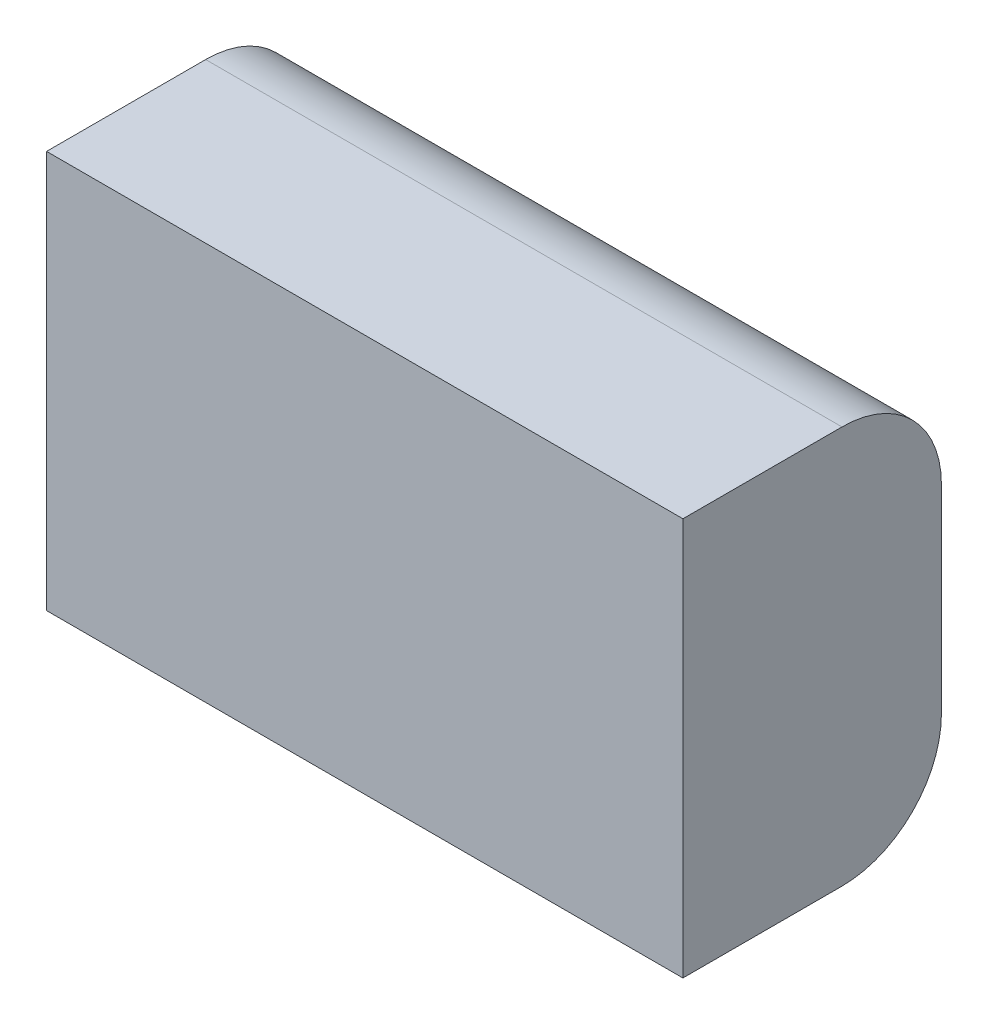
ISO-10303-21;
HEADER;
FILE_DESCRIPTION(('STEP AP214'),'2;1');
FILE_NAME('part.step','',(''),(''),'','','');
FILE_SCHEMA(('AUTOMOTIVE_DESIGN { 1 0 10303 214 1 1 1 1 }'));
ENDSEC;
DATA;
#1=APPLICATION_CONTEXT('core data for automotive mechanical design processes');
#2=APPLICATION_PROTOCOL_DEFINITION('international standard','automotive_design',2000,#1);
#3=PRODUCT_CONTEXT('',#1,'mechanical');
#4=PRODUCT('Part','Part','',(#3));
#5=PRODUCT_RELATED_PRODUCT_CATEGORY('part','',(#4));
#6=PRODUCT_DEFINITION_FORMATION('','',#4);
#7=PRODUCT_DEFINITION_CONTEXT('part definition',#1,'design');
#8=PRODUCT_DEFINITION('design','',#6,#7);
#9=PRODUCT_DEFINITION_SHAPE('','',#8);
#10=(LENGTH_UNIT() NAMED_UNIT(*) SI_UNIT(.MILLI.,.METRE.));
#11=(NAMED_UNIT(*) PLANE_ANGLE_UNIT() SI_UNIT($,.RADIAN.));
#12=(NAMED_UNIT(*) SI_UNIT($,.STERADIAN.) SOLID_ANGLE_UNIT());
#13=UNCERTAINTY_MEASURE_WITH_UNIT(LENGTH_MEASURE(1.E-05),#10,'distance_accuracy_value','');
#14=(GEOMETRIC_REPRESENTATION_CONTEXT(3) GLOBAL_UNCERTAINTY_ASSIGNED_CONTEXT((#13)) GLOBAL_UNIT_ASSIGNED_CONTEXT((#10,
#11,#12)) REPRESENTATION_CONTEXT('',''));
#15=CARTESIAN_POINT('',(0.,0.,0.));
#16=DIRECTION('',(0.,0.,1.));
#17=DIRECTION('',(1.,0.,0.));
#18=AXIS2_PLACEMENT_3D('',#15,#16,#17);
#19=CARTESIAN_POINT('',(101.6,66.0216606498195,1.42635379061369));
#20=DIRECTION('',(0.,0.,-1.));
#21=DIRECTION('',(0.,1.,0.));
#22=AXIS2_PLACEMENT_3D('',#19,#20,#21);
#23=PLANE('',#22);
#24=DIRECTION('',(0.,-1.,0.));
#25=VECTOR('',#24,1.);
#26=CARTESIAN_POINT('',(-101.6,66.0216606498195,1.42635379061369));
#27=LINE('',#26,#25);
#28=CARTESIAN_POINT('',(-101.6,66.0216606498195,1.42635379061369));
#29=VERTEX_POINT('',#28);
#30=CARTESIAN_POINT('',(-101.6,-60.9783393501805,1.42635379061368));
#31=VERTEX_POINT('',#30);
#32=EDGE_CURVE('E116',#29,#31,#27,.T.);
#33=ORIENTED_EDGE('',*,*,#32,.T.);
#34=DIRECTION('',(-1.,0.,0.));
#35=VECTOR('',#34,1.);
#36=CARTESIAN_POINT('',(101.6,-60.9783393501805,1.42635379061368));
#37=LINE('',#36,#35);
#38=CARTESIAN_POINT('',(101.6,-60.9783393501805,1.42635379061368));
#39=VERTEX_POINT('',#38);
#40=EDGE_CURVE('E11',#39,#31,#37,.T.);
#41=ORIENTED_EDGE('',*,*,#40,.F.);
#42=DIRECTION('',(0.,-1.,0.));
#43=VECTOR('',#42,1.);
#44=CARTESIAN_POINT('',(101.6,66.0216606498195,1.42635379061369));
#45=LINE('',#44,#43);
#46=CARTESIAN_POINT('',(101.6,66.0216606498195,1.42635379061369));
#47=VERTEX_POINT('',#46);
#48=EDGE_CURVE('E126',#47,#39,#45,.T.);
#49=ORIENTED_EDGE('',*,*,#48,.F.);
#50=DIRECTION('',(-1.,0.,0.));
#51=VECTOR('',#50,1.);
#52=CARTESIAN_POINT('',(101.6,66.0216606498195,1.42635379061369));
#53=LINE('',#52,#51);
#54=EDGE_CURVE('E112',#47,#29,#53,.T.);
#55=ORIENTED_EDGE('',*,*,#54,.T.);
#56=EDGE_LOOP('',(#33,#41,#49,#55));
#57=FACE_BOUND('',#56,.T.);
#58=ADVANCED_FACE('F32',(#57),#23,.F.);
#59=CARTESIAN_POINT('',(101.6,-60.9783393501805,-49.3736462093863));
#60=DIRECTION('',(0.,1.,0.));
#61=DIRECTION('',(0.,0.,1.));
#62=AXIS2_PLACEMENT_3D('',#59,#60,#61);
#63=PLANE('',#62);
#64=DIRECTION('',(0.,0.,-1.));
#65=VECTOR('',#64,1.);
#66=CARTESIAN_POINT('',(-101.6,-60.9783393501805,-49.3736462093863));
#67=LINE('',#66,#65);
#68=CARTESIAN_POINT('',(-101.6,-60.9783393501805,-49.3736462093863));
#69=VERTEX_POINT('',#68);
#70=EDGE_CURVE('E119',#31,#69,#67,.T.);
#71=ORIENTED_EDGE('',*,*,#70,.T.);
#72=DIRECTION('',(-1.,0.,0.));
#73=VECTOR('',#72,1.);
#74=CARTESIAN_POINT('',(101.6,-60.9783393501805,-49.3736462093863));
#75=LINE('',#74,#73);
#76=CARTESIAN_POINT('',(101.6,-60.9783393501805,-49.3736462093863));
#77=VERTEX_POINT('',#76);
#78=EDGE_CURVE('E40',#77,#69,#75,.T.);
#79=ORIENTED_EDGE('',*,*,#78,.F.);
#80=DIRECTION('',(0.,0.,-1.));
#81=VECTOR('',#80,1.);
#82=CARTESIAN_POINT('',(101.6,-60.9783393501805,-49.3736462093863));
#83=LINE('',#82,#81);
#84=EDGE_CURVE('E85',#39,#77,#83,.T.);
#85=ORIENTED_EDGE('',*,*,#84,.F.);
#86=ORIENTED_EDGE('',*,*,#40,.T.);
#87=EDGE_LOOP('',(#71,#79,#85,#86));
#88=FACE_BOUND('',#87,.T.);
#89=ADVANCED_FACE('F150',(#88),#63,.F.);
#90=CARTESIAN_POINT('',(101.6,-29.2283393501805,-49.3736462093863));
#91=DIRECTION('',(-1.,0.,0.));
#92=DIRECTION('',(0.,0.,1.));
#93=AXIS2_PLACEMENT_3D('',#90,#91,#92);
#94=CYLINDRICAL_SURFACE('',#93,31.75);
#95=CARTESIAN_POINT('',(-101.6,-29.2283393501805,-49.3736462093863));
#96=DIRECTION('',(1.,0.,0.));
#97=DIRECTION('',(0.,0.,1.));
#98=AXIS2_PLACEMENT_3D('',#95,#96,#97);
#99=CIRCLE('',#98,31.75);
#100=CARTESIAN_POINT('',(-101.6,-29.2283393501805,-81.1236462093863));
#101=VERTEX_POINT('',#100);
#102=EDGE_CURVE('E121',#69,#101,#99,.T.);
#103=ORIENTED_EDGE('',*,*,#102,.T.);
#104=DIRECTION('',(-1.,0.,0.));
#105=VECTOR('',#104,1.);
#106=CARTESIAN_POINT('',(101.6,-29.2283393501805,-81.1236462093863));
#107=LINE('',#106,#105);
#108=CARTESIAN_POINT('',(101.6,-29.2283393501805,-81.1236462093863));
#109=VERTEX_POINT('',#108);
#110=EDGE_CURVE('E107',#109,#101,#107,.T.);
#111=ORIENTED_EDGE('',*,*,#110,.F.);
#112=CARTESIAN_POINT('',(101.6,-29.2283393501805,-49.3736462093863));
#113=DIRECTION('',(1.,0.,0.));
#114=DIRECTION('',(0.,0.,1.));
#115=AXIS2_PLACEMENT_3D('',#112,#113,#114);
#116=CIRCLE('',#115,31.75);
#117=EDGE_CURVE('E98',#77,#109,#116,.T.);
#118=ORIENTED_EDGE('',*,*,#117,.F.);
#119=ORIENTED_EDGE('',*,*,#78,.T.);
#120=EDGE_LOOP('',(#103,#111,#118,#119));
#121=FACE_BOUND('',#120,.T.);
#122=ADVANCED_FACE('F132',(#121),#94,.T.);
#123=CARTESIAN_POINT('',(101.6,34.2716606498195,-81.1236462093863));
#124=DIRECTION('',(0.,0.,1.));
#125=DIRECTION('',(0.,-1.,0.));
#126=AXIS2_PLACEMENT_3D('',#123,#124,#125);
#127=PLANE('',#126);
#128=DIRECTION('',(0.,1.,0.));
#129=VECTOR('',#128,1.);
#130=CARTESIAN_POINT('',(-101.6,34.2716606498195,-81.1236462093863));
#131=LINE('',#130,#129);
#132=CARTESIAN_POINT('',(-101.6,34.2716606498195,-81.1236462093863));
#133=VERTEX_POINT('',#132);
#134=EDGE_CURVE('E106',#101,#133,#131,.T.);
#135=ORIENTED_EDGE('',*,*,#134,.T.);
#136=DIRECTION('',(-1.,0.,0.));
#137=VECTOR('',#136,1.);
#138=CARTESIAN_POINT('',(101.6,34.2716606498195,-81.1236462093863));
#139=LINE('',#138,#137);
#140=CARTESIAN_POINT('',(101.6,34.2716606498195,-81.1236462093863));
#141=VERTEX_POINT('',#140);
#142=EDGE_CURVE('E103',#141,#133,#139,.T.);
#143=ORIENTED_EDGE('',*,*,#142,.F.);
#144=DIRECTION('',(0.,1.,0.));
#145=VECTOR('',#144,1.);
#146=CARTESIAN_POINT('',(101.6,34.2716606498195,-81.1236462093863));
#147=LINE('',#146,#145);
#148=EDGE_CURVE('E92',#109,#141,#147,.T.);
#149=ORIENTED_EDGE('',*,*,#148,.F.);
#150=ORIENTED_EDGE('',*,*,#110,.T.);
#151=EDGE_LOOP('',(#135,#143,#149,#150));
#152=FACE_BOUND('',#151,.T.);
#153=ADVANCED_FACE('F104',(#152),#127,.F.);
#154=CARTESIAN_POINT('',(101.6,34.2716606498195,-49.3736462093863));
#155=DIRECTION('',(-1.,0.,0.));
#156=DIRECTION('',(0.,0.,1.));
#157=AXIS2_PLACEMENT_3D('',#154,#155,#156);
#158=CYLINDRICAL_SURFACE('',#157,31.75);
#159=CARTESIAN_POINT('',(-101.6,34.2716606498195,-49.3736462093863));
#160=DIRECTION('',(1.,0.,0.));
#161=DIRECTION('',(0.,0.,1.));
#162=AXIS2_PLACEMENT_3D('',#159,#160,#161);
#163=CIRCLE('',#162,31.75);
#164=CARTESIAN_POINT('',(-101.6,66.0216606498195,-49.3736462093862));
#165=VERTEX_POINT('',#164);
#166=EDGE_CURVE('E71',#133,#165,#163,.T.);
#167=ORIENTED_EDGE('',*,*,#166,.T.);
#168=DIRECTION('',(-1.,0.,0.));
#169=VECTOR('',#168,1.);
#170=CARTESIAN_POINT('',(101.6,66.0216606498195,-49.3736462093862));
#171=LINE('',#170,#169);
#172=CARTESIAN_POINT('',(101.6,66.0216606498195,-49.3736462093862));
#173=VERTEX_POINT('',#172);
#174=EDGE_CURVE('E108',#173,#165,#171,.T.);
#175=ORIENTED_EDGE('',*,*,#174,.F.);
#176=CARTESIAN_POINT('',(101.6,34.2716606498195,-49.3736462093863));
#177=DIRECTION('',(1.,0.,0.));
#178=DIRECTION('',(0.,0.,1.));
#179=AXIS2_PLACEMENT_3D('',#176,#177,#178);
#180=CIRCLE('',#179,31.75);
#181=EDGE_CURVE('E96',#141,#173,#180,.T.);
#182=ORIENTED_EDGE('',*,*,#181,.F.);
#183=ORIENTED_EDGE('',*,*,#142,.T.);
#184=EDGE_LOOP('',(#167,#175,#182,#183));
#185=FACE_BOUND('',#184,.T.);
#186=ADVANCED_FACE('F110',(#185),#158,.T.);
#187=CARTESIAN_POINT('',(101.6,66.0216606498195,-49.3736462093862));
#188=DIRECTION('',(0.,-1.,0.));
#189=DIRECTION('',(0.,0.,-1.));
#190=AXIS2_PLACEMENT_3D('',#187,#188,#189);
#191=PLANE('',#190);
#192=DIRECTION('',(0.,0.,1.));
#193=VECTOR('',#192,1.);
#194=CARTESIAN_POINT('',(-101.6,66.0216606498195,-49.3736462093862));
#195=LINE('',#194,#193);
#196=EDGE_CURVE('E77',#165,#29,#195,.T.);
#197=ORIENTED_EDGE('',*,*,#196,.T.);
#198=ORIENTED_EDGE('',*,*,#54,.F.);
#199=DIRECTION('',(0.,0.,1.));
#200=VECTOR('',#199,1.);
#201=CARTESIAN_POINT('',(101.6,66.0216606498195,-49.3736462093862));
#202=LINE('',#201,#200);
#203=EDGE_CURVE('E48',#173,#47,#202,.T.);
#204=ORIENTED_EDGE('',*,*,#203,.F.);
#205=ORIENTED_EDGE('',*,*,#174,.T.);
#206=EDGE_LOOP('',(#197,#198,#204,#205));
#207=FACE_BOUND('',#206,.T.);
#208=ADVANCED_FACE('F139',(#207),#191,.F.);
#209=CARTESIAN_POINT('',(101.6,-29.2283393501805,-49.3736462093863));
#210=DIRECTION('',(-1.,0.,0.));
#211=DIRECTION('',(0.,0.,1.));
#212=AXIS2_PLACEMENT_3D('',#209,#210,#211);
#213=PLANE('',#212);
#214=ORIENTED_EDGE('',*,*,#48,.T.);
#215=ORIENTED_EDGE('',*,*,#84,.T.);
#216=ORIENTED_EDGE('',*,*,#117,.T.);
#217=ORIENTED_EDGE('',*,*,#148,.T.);
#218=ORIENTED_EDGE('',*,*,#181,.T.);
#219=ORIENTED_EDGE('',*,*,#203,.T.);
#220=EDGE_LOOP('',(#214,#215,#216,#217,#218,#219));
#221=FACE_BOUND('',#220,.T.);
#222=ADVANCED_FACE('F94',(#221),#213,.F.);
#223=CARTESIAN_POINT('',(-101.6,-29.2283393501805,-49.3736462093863));
#224=DIRECTION('',(-1.,0.,0.));
#225=DIRECTION('',(0.,0.,1.));
#226=AXIS2_PLACEMENT_3D('',#223,#224,#225);
#227=PLANE('',#226);
#228=ORIENTED_EDGE('',*,*,#32,.F.);
#229=ORIENTED_EDGE('',*,*,#196,.F.);
#230=ORIENTED_EDGE('',*,*,#166,.F.);
#231=ORIENTED_EDGE('',*,*,#134,.F.);
#232=ORIENTED_EDGE('',*,*,#102,.F.);
#233=ORIENTED_EDGE('',*,*,#70,.F.);
#234=EDGE_LOOP('',(#228,#229,#230,#231,#232,#233));
#235=FACE_BOUND('',#234,.T.);
#236=ADVANCED_FACE('F135',(#235),#227,.T.);
#237=CLOSED_SHELL('',(#58,#89,#122,#153,#186,#208,#222,#236));
#238=MANIFOLD_SOLID_BREP('B2',#237);
#239=ADVANCED_BREP_SHAPE_REPRESENTATION('',(#18,#238),#14);
#240=SHAPE_DEFINITION_REPRESENTATION(#9,#239);
ENDSEC;
END-ISO-10303-21;
